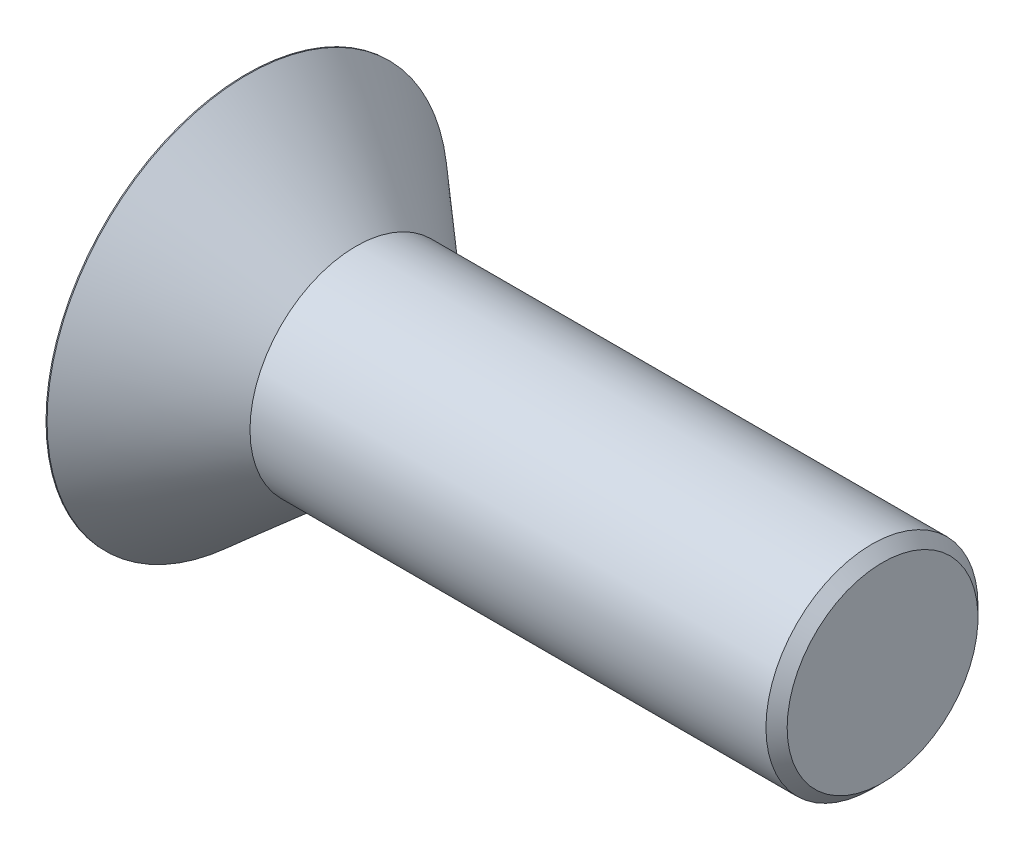
ISO-10303-21;
HEADER;
FILE_DESCRIPTION(('STEP AP214'),'2;1');
FILE_NAME('part.step','',(''),(''),'','','');
FILE_SCHEMA(('AUTOMOTIVE_DESIGN { 1 0 10303 214 1 1 1 1 }'));
ENDSEC;
DATA;
#1=APPLICATION_CONTEXT('core data for automotive mechanical design processes');
#2=APPLICATION_PROTOCOL_DEFINITION('international standard','automotive_design',2000,#1);
#3=PRODUCT_CONTEXT('',#1,'mechanical');
#4=PRODUCT('Part','Part','',(#3));
#5=PRODUCT_RELATED_PRODUCT_CATEGORY('part','',(#4));
#6=PRODUCT_DEFINITION_FORMATION('','',#4);
#7=PRODUCT_DEFINITION_CONTEXT('part definition',#1,'design');
#8=PRODUCT_DEFINITION('design','',#6,#7);
#9=PRODUCT_DEFINITION_SHAPE('','',#8);
#10=(LENGTH_UNIT() NAMED_UNIT(*) SI_UNIT(.MILLI.,.METRE.));
#11=(NAMED_UNIT(*) PLANE_ANGLE_UNIT() SI_UNIT($,.RADIAN.));
#12=(NAMED_UNIT(*) SI_UNIT($,.STERADIAN.) SOLID_ANGLE_UNIT());
#13=UNCERTAINTY_MEASURE_WITH_UNIT(LENGTH_MEASURE(1.E-05),#10,'distance_accuracy_value','');
#14=(GEOMETRIC_REPRESENTATION_CONTEXT(3) GLOBAL_UNCERTAINTY_ASSIGNED_CONTEXT((#13)) GLOBAL_UNIT_ASSIGNED_CONTEXT((#10,
#11,#12)) REPRESENTATION_CONTEXT('',''));
#15=CARTESIAN_POINT('',(0.,0.,0.));
#16=DIRECTION('',(0.,0.,1.));
#17=DIRECTION('',(1.,0.,0.));
#18=AXIS2_PLACEMENT_3D('',#15,#16,#17);
#19=CARTESIAN_POINT('',(0.,0.,0.));
#20=DIRECTION('',(-1.,0.,0.));
#21=DIRECTION('',(0.,0.,1.));
#22=AXIS2_PLACEMENT_3D('',#19,#20,#21);
#23=PLANE('',#22);
#24=CARTESIAN_POINT('',(0.,0.,0.));
#25=DIRECTION('',(-1.,0.,0.));
#26=DIRECTION('',(0.,0.,1.));
#27=AXIS2_PLACEMENT_3D('',#24,#25,#26);
#28=CIRCLE('',#27,24.003);
#29=CARTESIAN_POINT('',(0.,0.,24.003));
#30=VERTEX_POINT('',#29);
#31=EDGE_CURVE('E11',#30,#30,#28,.T.);
#32=ORIENTED_EDGE('',*,*,#31,.T.);
#33=EDGE_LOOP('',(#32));
#34=FACE_BOUND('',#33,.T.);
#35=DIRECTION('',(0.,-0.5,-0.866025403784438));
#36=VECTOR('',#35,1.);
#37=CARTESIAN_POINT('',(0.,-4.58271776169265,7.9375));
#38=LINE('',#37,#36);
#39=CARTESIAN_POINT('',(0.,-4.58271776169265,7.9375));
#40=VERTEX_POINT('',#39);
#41=CARTESIAN_POINT('',(0.,-9.16543552338531,0.));
#42=VERTEX_POINT('',#41);
#43=EDGE_CURVE('E116',#40,#42,#38,.T.);
#44=ORIENTED_EDGE('',*,*,#43,.T.);
#45=DIRECTION('',(0.,0.5,-0.866025403784438));
#46=VECTOR('',#45,1.);
#47=CARTESIAN_POINT('',(0.,-9.16543552338531,0.));
#48=LINE('',#47,#46);
#49=CARTESIAN_POINT('',(0.,-4.58271776169265,-7.9375));
#50=VERTEX_POINT('',#49);
#51=EDGE_CURVE('E46',#42,#50,#48,.T.);
#52=ORIENTED_EDGE('',*,*,#51,.T.);
#53=DIRECTION('',(0.,1.,0.));
#54=VECTOR('',#53,1.);
#55=CARTESIAN_POINT('',(0.,-4.58271776169265,-7.9375));
#56=LINE('',#55,#54);
#57=CARTESIAN_POINT('',(0.,4.58271776169265,-7.9375));
#58=VERTEX_POINT('',#57);
#59=EDGE_CURVE('E131',#50,#58,#56,.T.);
#60=ORIENTED_EDGE('',*,*,#59,.T.);
#61=DIRECTION('',(0.,0.5,0.866025403784439));
#62=VECTOR('',#61,1.);
#63=CARTESIAN_POINT('',(0.,4.58271776169265,-7.9375));
#64=LINE('',#63,#62);
#65=CARTESIAN_POINT('',(0.,9.16543552338531,0.));
#66=VERTEX_POINT('',#65);
#67=EDGE_CURVE('E201',#58,#66,#64,.T.);
#68=ORIENTED_EDGE('',*,*,#67,.T.);
#69=DIRECTION('',(0.,-0.5,0.866025403784439));
#70=VECTOR('',#69,1.);
#71=CARTESIAN_POINT('',(0.,9.16543552338531,0.));
#72=LINE('',#71,#70);
#73=CARTESIAN_POINT('',(0.,4.58271776169265,7.9375));
#74=VERTEX_POINT('',#73);
#75=EDGE_CURVE('E185',#66,#74,#72,.T.);
#76=ORIENTED_EDGE('',*,*,#75,.T.);
#77=DIRECTION('',(0.,-1.,0.));
#78=VECTOR('',#77,1.);
#79=CARTESIAN_POINT('',(0.,4.58271776169265,7.9375));
#80=LINE('',#79,#78);
#81=EDGE_CURVE('E180',#74,#40,#80,.T.);
#82=ORIENTED_EDGE('',*,*,#81,.T.);
#83=EDGE_LOOP('',(#44,#52,#60,#68,#76,#82));
#84=FACE_BOUND('',#83,.T.);
#85=ADVANCED_FACE('F32',(#34,#84),#23,.T.);
#86=CARTESIAN_POINT('',(0.,0.,0.));
#87=DIRECTION('',(-1.,0.,0.));
#88=DIRECTION('',(0.,0.,1.));
#89=AXIS2_PLACEMENT_3D('',#86,#87,#88);
#90=CYLINDRICAL_SURFACE('',#89,24.003);
#91=CARTESIAN_POINT('',(0.127,0.,0.));
#92=DIRECTION('',(-1.,0.,0.));
#93=DIRECTION('',(0.,0.,1.));
#94=AXIS2_PLACEMENT_3D('',#91,#92,#93);
#95=CIRCLE('',#94,24.003);
#96=CARTESIAN_POINT('',(0.127,0.,24.003));
#97=VERTEX_POINT('',#96);
#98=EDGE_CURVE('E39',#97,#97,#95,.T.);
#99=ORIENTED_EDGE('',*,*,#98,.T.);
#100=EDGE_LOOP('',(#99));
#101=FACE_BOUND('',#100,.T.);
#102=ORIENTED_EDGE('',*,*,#31,.F.);
#103=EDGE_LOOP('',(#102));
#104=FACE_BOUND('',#103,.T.);
#105=ADVANCED_FACE('F156',(#101,#104),#90,.T.);
#106=CARTESIAN_POINT('',(0.127,0.,0.));
#107=DIRECTION('',(-1.,0.,0.));
#108=DIRECTION('',(0.,0.,1.));
#109=AXIS2_PLACEMENT_3D('',#106,#107,#108);
#110=CONICAL_SURFACE('',#109,24.003,0.715584993317677);
#111=CARTESIAN_POINT('',(13.129614106819,0.,0.));
#112=DIRECTION('',(-1.,0.,0.));
#113=DIRECTION('',(0.,0.,1.));
#114=AXIS2_PLACEMENT_3D('',#111,#112,#113);
#115=CIRCLE('',#114,12.7);
#116=CARTESIAN_POINT('',(13.129614106819,0.,12.7));
#117=VERTEX_POINT('',#116);
#118=EDGE_CURVE('E151',#117,#117,#115,.T.);
#119=ORIENTED_EDGE('',*,*,#118,.T.);
#120=EDGE_LOOP('',(#119));
#121=FACE_BOUND('',#120,.T.);
#122=ORIENTED_EDGE('',*,*,#98,.F.);
#123=EDGE_LOOP('',(#122));
#124=FACE_BOUND('',#123,.T.);
#125=ADVANCED_FACE('F159',(#121,#124),#110,.T.);
#126=CARTESIAN_POINT('',(0.,0.,0.));
#127=DIRECTION('',(-1.,0.,0.));
#128=DIRECTION('',(0.,0.,1.));
#129=AXIS2_PLACEMENT_3D('',#126,#127,#128);
#130=CYLINDRICAL_SURFACE('',#129,12.7);
#131=CARTESIAN_POINT('',(74.93,0.,0.));
#132=DIRECTION('',(-1.,0.,0.));
#133=DIRECTION('',(0.,0.,1.));
#134=AXIS2_PLACEMENT_3D('',#131,#132,#133);
#135=CIRCLE('',#134,12.7);
#136=CARTESIAN_POINT('',(74.93,0.,12.7));
#137=VERTEX_POINT('',#136);
#138=EDGE_CURVE('E148',#137,#137,#135,.T.);
#139=ORIENTED_EDGE('',*,*,#138,.T.);
#140=EDGE_LOOP('',(#139));
#141=FACE_BOUND('',#140,.T.);
#142=ORIENTED_EDGE('',*,*,#118,.F.);
#143=EDGE_LOOP('',(#142));
#144=FACE_BOUND('',#143,.T.);
#145=ADVANCED_FACE('F161',(#141,#144),#130,.T.);
#146=CARTESIAN_POINT('',(76.2,0.,0.));
#147=DIRECTION('',(-1.,0.,0.));
#148=DIRECTION('',(0.,0.,1.));
#149=AXIS2_PLACEMENT_3D('',#146,#147,#148);
#150=CONICAL_SURFACE('',#149,11.43,0.785398163397468);
#151=ORIENTED_EDGE('',*,*,#138,.F.);
#152=EDGE_LOOP('',(#151));
#153=FACE_BOUND('',#152,.T.);
#154=CARTESIAN_POINT('',(76.2,0.,0.));
#155=DIRECTION('',(-1.,0.,0.));
#156=DIRECTION('',(0.,0.,1.));
#157=AXIS2_PLACEMENT_3D('',#154,#155,#156);
#158=CIRCLE('',#157,11.43);
#159=CARTESIAN_POINT('',(76.2,0.,11.43));
#160=VERTEX_POINT('',#159);
#161=EDGE_CURVE('E144',#160,#160,#158,.T.);
#162=ORIENTED_EDGE('',*,*,#161,.T.);
#163=EDGE_LOOP('',(#162));
#164=FACE_BOUND('',#163,.T.);
#165=ADVANCED_FACE('F168',(#153,#164),#150,.T.);
#166=CARTESIAN_POINT('',(76.2,11.43,0.));
#167=DIRECTION('',(1.,0.,0.));
#168=DIRECTION('',(0.,0.,-1.));
#169=AXIS2_PLACEMENT_3D('',#166,#167,#168);
#170=PLANE('',#169);
#171=ORIENTED_EDGE('',*,*,#161,.F.);
#172=EDGE_LOOP('',(#171));
#173=FACE_BOUND('',#172,.T.);
#174=ADVANCED_FACE('F256',(#173),#170,.T.);
#175=CARTESIAN_POINT('',(7.5438,-9.16543552338531,0.));
#176=DIRECTION('',(0.,0.866025403784439,0.5));
#177=DIRECTION('',(0.,-0.5,0.866025403784439));
#178=AXIS2_PLACEMENT_3D('',#175,#176,#177);
#179=PLANE('',#178);
#180=ORIENTED_EDGE('',*,*,#51,.F.);
#181=DIRECTION('',(-1.,0.,0.));
#182=VECTOR('',#181,1.);
#183=CARTESIAN_POINT('',(7.5438,-9.16543552338531,0.));
#184=LINE('',#183,#182);
#185=CARTESIAN_POINT('',(7.5438,-9.16543552338531,0.));
#186=VERTEX_POINT('',#185);
#187=EDGE_CURVE('E189',#186,#42,#184,.T.);
#188=ORIENTED_EDGE('',*,*,#187,.F.);
#189=DIRECTION('',(0.,0.5,-0.866025403784438));
#190=VECTOR('',#189,1.);
#191=CARTESIAN_POINT('',(7.5438,-9.16543552338531,0.));
#192=LINE('',#191,#190);
#193=CARTESIAN_POINT('',(7.5438,-6.87407664253898,-3.96875));
#194=VERTEX_POINT('',#193);
#195=EDGE_CURVE('E113',#186,#194,#192,.T.);
#196=ORIENTED_EDGE('',*,*,#195,.T.);
#197=CARTESIAN_POINT('',(7.5438,-4.58271776169265,-7.9375));
#198=VERTEX_POINT('',#197);
#199=EDGE_CURVE('E107',#194,#198,#192,.T.);
#200=ORIENTED_EDGE('',*,*,#199,.T.);
#201=DIRECTION('',(-1.,0.,0.));
#202=VECTOR('',#201,1.);
#203=CARTESIAN_POINT('',(7.5438,-4.58271776169265,-7.9375));
#204=LINE('',#203,#202);
#205=EDGE_CURVE('E111',#198,#50,#204,.T.);
#206=ORIENTED_EDGE('',*,*,#205,.T.);
#207=EDGE_LOOP('',(#180,#188,#196,#200,#206));
#208=FACE_BOUND('',#207,.T.);
#209=ADVANCED_FACE('F109',(#208),#179,.T.);
#210=CARTESIAN_POINT('',(7.5438,-4.58271776169265,-7.9375));
#211=DIRECTION('',(0.,0.,1.));
#212=DIRECTION('',(0.,-1.,0.));
#213=AXIS2_PLACEMENT_3D('',#210,#211,#212);
#214=PLANE('',#213);
#215=ORIENTED_EDGE('',*,*,#59,.F.);
#216=ORIENTED_EDGE('',*,*,#205,.F.);
#217=DIRECTION('',(0.,1.,0.));
#218=VECTOR('',#217,1.);
#219=CARTESIAN_POINT('',(7.5438,-4.58271776169265,-7.9375));
#220=LINE('',#219,#218);
#221=CARTESIAN_POINT('',(7.5438,0.,-7.9375));
#222=VERTEX_POINT('',#221);
#223=EDGE_CURVE('E119',#198,#222,#220,.T.);
#224=ORIENTED_EDGE('',*,*,#223,.T.);
#225=CARTESIAN_POINT('',(7.5438,4.58271776169265,-7.9375));
#226=VERTEX_POINT('',#225);
#227=EDGE_CURVE('E126',#222,#226,#220,.T.);
#228=ORIENTED_EDGE('',*,*,#227,.T.);
#229=DIRECTION('',(-1.,0.,0.));
#230=VECTOR('',#229,1.);
#231=CARTESIAN_POINT('',(7.5438,4.58271776169265,-7.9375));
#232=LINE('',#231,#230);
#233=EDGE_CURVE('E133',#226,#58,#232,.T.);
#234=ORIENTED_EDGE('',*,*,#233,.T.);
#235=EDGE_LOOP('',(#215,#216,#224,#228,#234));
#236=FACE_BOUND('',#235,.T.);
#237=ADVANCED_FACE('F128',(#236),#214,.T.);
#238=CARTESIAN_POINT('',(7.5438,4.58271776169265,-7.9375));
#239=DIRECTION('',(0.,-0.866025403784439,0.5));
#240=DIRECTION('',(0.,-0.5,-0.866025403784439));
#241=AXIS2_PLACEMENT_3D('',#238,#239,#240);
#242=PLANE('',#241);
#243=ORIENTED_EDGE('',*,*,#67,.F.);
#244=ORIENTED_EDGE('',*,*,#233,.F.);
#245=DIRECTION('',(0.,0.5,0.866025403784439));
#246=VECTOR('',#245,1.);
#247=CARTESIAN_POINT('',(7.5438,4.58271776169265,-7.9375));
#248=LINE('',#247,#246);
#249=CARTESIAN_POINT('',(7.5438,6.87407664253898,-3.96875));
#250=VERTEX_POINT('',#249);
#251=EDGE_CURVE('E217',#226,#250,#248,.T.);
#252=ORIENTED_EDGE('',*,*,#251,.T.);
#253=CARTESIAN_POINT('',(7.5438,9.16543552338531,0.));
#254=VERTEX_POINT('',#253);
#255=EDGE_CURVE('E125',#250,#254,#248,.T.);
#256=ORIENTED_EDGE('',*,*,#255,.T.);
#257=DIRECTION('',(-1.,0.,0.));
#258=VECTOR('',#257,1.);
#259=CARTESIAN_POINT('',(7.5438,9.16543552338531,0.));
#260=LINE('',#259,#258);
#261=EDGE_CURVE('E139',#254,#66,#260,.T.);
#262=ORIENTED_EDGE('',*,*,#261,.T.);
#263=EDGE_LOOP('',(#243,#244,#252,#256,#262));
#264=FACE_BOUND('',#263,.T.);
#265=ADVANCED_FACE('F199',(#264),#242,.T.);
#266=CARTESIAN_POINT('',(7.5438,9.16543552338531,0.));
#267=DIRECTION('',(0.,-0.866025403784439,-0.5));
#268=DIRECTION('',(0.,0.5,-0.866025403784439));
#269=AXIS2_PLACEMENT_3D('',#266,#267,#268);
#270=PLANE('',#269);
#271=ORIENTED_EDGE('',*,*,#75,.F.);
#272=ORIENTED_EDGE('',*,*,#261,.F.);
#273=DIRECTION('',(0.,-0.5,0.866025403784439));
#274=VECTOR('',#273,1.);
#275=CARTESIAN_POINT('',(7.5438,9.16543552338531,0.));
#276=LINE('',#275,#274);
#277=CARTESIAN_POINT('',(7.5438,6.87407664253898,3.96875));
#278=VERTEX_POINT('',#277);
#279=EDGE_CURVE('E54',#254,#278,#276,.T.);
#280=ORIENTED_EDGE('',*,*,#279,.T.);
#281=CARTESIAN_POINT('',(7.5438,4.58271776169265,7.9375));
#282=VERTEX_POINT('',#281);
#283=EDGE_CURVE('E216',#278,#282,#276,.T.);
#284=ORIENTED_EDGE('',*,*,#283,.T.);
#285=DIRECTION('',(-1.,0.,0.));
#286=VECTOR('',#285,1.);
#287=CARTESIAN_POINT('',(7.5438,4.58271776169265,7.9375));
#288=LINE('',#287,#286);
#289=EDGE_CURVE('E194',#282,#74,#288,.T.);
#290=ORIENTED_EDGE('',*,*,#289,.T.);
#291=EDGE_LOOP('',(#271,#272,#280,#284,#290));
#292=FACE_BOUND('',#291,.T.);
#293=ADVANCED_FACE('F240',(#292),#270,.T.);
#294=CARTESIAN_POINT('',(7.5438,4.58271776169265,7.9375));
#295=DIRECTION('',(0.,0.,-1.));
#296=DIRECTION('',(-1.,0.,0.));
#297=AXIS2_PLACEMENT_3D('',#294,#295,#296);
#298=PLANE('',#297);
#299=ORIENTED_EDGE('',*,*,#81,.F.);
#300=ORIENTED_EDGE('',*,*,#289,.F.);
#301=DIRECTION('',(0.,-1.,0.));
#302=VECTOR('',#301,1.);
#303=CARTESIAN_POINT('',(7.5438,4.58271776169265,7.9375));
#304=LINE('',#303,#302);
#305=CARTESIAN_POINT('',(7.5438,0.,7.9375));
#306=VERTEX_POINT('',#305);
#307=EDGE_CURVE('E211',#282,#306,#304,.T.);
#308=ORIENTED_EDGE('',*,*,#307,.T.);
#309=CARTESIAN_POINT('',(7.5438,-4.58271776169265,7.9375));
#310=VERTEX_POINT('',#309);
#311=EDGE_CURVE('E214',#306,#310,#304,.T.);
#312=ORIENTED_EDGE('',*,*,#311,.T.);
#313=DIRECTION('',(-1.,0.,0.));
#314=VECTOR('',#313,1.);
#315=CARTESIAN_POINT('',(7.5438,-4.58271776169265,7.9375));
#316=LINE('',#315,#314);
#317=EDGE_CURVE('E191',#310,#40,#316,.T.);
#318=ORIENTED_EDGE('',*,*,#317,.T.);
#319=EDGE_LOOP('',(#299,#300,#308,#312,#318));
#320=FACE_BOUND('',#319,.T.);
#321=ADVANCED_FACE('F239',(#320),#298,.T.);
#322=CARTESIAN_POINT('',(7.5438,-4.58271776169265,7.9375));
#323=DIRECTION('',(0.,0.866025403784438,-0.5));
#324=DIRECTION('',(0.,0.5,0.866025403784439));
#325=AXIS2_PLACEMENT_3D('',#322,#323,#324);
#326=PLANE('',#325);
#327=ORIENTED_EDGE('',*,*,#43,.F.);
#328=ORIENTED_EDGE('',*,*,#317,.F.);
#329=DIRECTION('',(0.,-0.5,-0.866025403784438));
#330=VECTOR('',#329,1.);
#331=CARTESIAN_POINT('',(7.5438,-4.58271776169265,7.9375));
#332=LINE('',#331,#330);
#333=CARTESIAN_POINT('',(7.5438,-6.87407664253898,3.96875));
#334=VERTEX_POINT('',#333);
#335=EDGE_CURVE('E192',#310,#334,#332,.T.);
#336=ORIENTED_EDGE('',*,*,#335,.T.);
#337=EDGE_CURVE('E210',#334,#186,#332,.T.);
#338=ORIENTED_EDGE('',*,*,#337,.T.);
#339=ORIENTED_EDGE('',*,*,#187,.T.);
#340=EDGE_LOOP('',(#327,#328,#336,#338,#339));
#341=FACE_BOUND('',#340,.T.);
#342=ADVANCED_FACE('F247',(#341),#326,.T.);
#343=CARTESIAN_POINT('',(7.5438,-9.16543552338531,0.));
#344=DIRECTION('',(-1.,0.,0.));
#345=DIRECTION('',(0.,0.,1.));
#346=AXIS2_PLACEMENT_3D('',#343,#344,#345);
#347=PLANE('',#346);
#348=CARTESIAN_POINT('',(7.5438,0.,0.));
#349=DIRECTION('',(-1.,0.,0.));
#350=DIRECTION('',(0.,0.,1.));
#351=AXIS2_PLACEMENT_3D('',#348,#349,#350);
#352=CIRCLE('',#351,7.9375);
#353=EDGE_CURVE('E132',#334,#306,#352,.T.);
#354=ORIENTED_EDGE('',*,*,#353,.F.);
#355=ORIENTED_EDGE('',*,*,#335,.F.);
#356=ORIENTED_EDGE('',*,*,#311,.F.);
#357=EDGE_LOOP('',(#354,#355,#356));
#358=FACE_BOUND('',#357,.T.);
#359=ADVANCED_FACE('F235',(#358),#347,.T.);
#360=EDGE_CURVE('E136',#194,#334,#352,.T.);
#361=ORIENTED_EDGE('',*,*,#360,.F.);
#362=ORIENTED_EDGE('',*,*,#195,.F.);
#363=ORIENTED_EDGE('',*,*,#337,.F.);
#364=EDGE_LOOP('',(#361,#362,#363));
#365=FACE_BOUND('',#364,.T.);
#366=ADVANCED_FACE('F316',(#365),#347,.T.);
#367=EDGE_CURVE('E121',#222,#194,#352,.T.);
#368=ORIENTED_EDGE('',*,*,#367,.F.);
#369=ORIENTED_EDGE('',*,*,#223,.F.);
#370=ORIENTED_EDGE('',*,*,#199,.F.);
#371=EDGE_LOOP('',(#368,#369,#370));
#372=FACE_BOUND('',#371,.T.);
#373=ADVANCED_FACE('F120',(#372),#347,.T.);
#374=EDGE_CURVE('E222',#250,#222,#352,.T.);
#375=ORIENTED_EDGE('',*,*,#374,.F.);
#376=ORIENTED_EDGE('',*,*,#251,.F.);
#377=ORIENTED_EDGE('',*,*,#227,.F.);
#378=EDGE_LOOP('',(#375,#376,#377));
#379=FACE_BOUND('',#378,.T.);
#380=ADVANCED_FACE('F221',(#379),#347,.T.);
#381=EDGE_CURVE('E145',#278,#250,#352,.T.);
#382=ORIENTED_EDGE('',*,*,#381,.F.);
#383=ORIENTED_EDGE('',*,*,#279,.F.);
#384=ORIENTED_EDGE('',*,*,#255,.F.);
#385=EDGE_LOOP('',(#382,#383,#384));
#386=FACE_BOUND('',#385,.T.);
#387=ADVANCED_FACE('F226',(#386),#347,.T.);
#388=EDGE_CURVE('E138',#306,#278,#352,.T.);
#389=ORIENTED_EDGE('',*,*,#388,.F.);
#390=ORIENTED_EDGE('',*,*,#307,.F.);
#391=ORIENTED_EDGE('',*,*,#283,.F.);
#392=EDGE_LOOP('',(#389,#390,#391));
#393=FACE_BOUND('',#392,.T.);
#394=ADVANCED_FACE('F232',(#393),#347,.T.);
#395=CARTESIAN_POINT('',(7.5438,0.,0.));
#396=DIRECTION('',(-1.,0.,0.));
#397=DIRECTION('',(0.,0.,1.));
#398=AXIS2_PLACEMENT_3D('',#395,#396,#397);
#399=CONICAL_SURFACE('',#398,7.9375,1.04719755119659);
#400=CARTESIAN_POINT('',(12.1265177616927,0.,0.));
#401=VERTEX_POINT('',#400);
#402=VERTEX_LOOP('',#401);
#403=FACE_BOUND('',#402,.T.);
#404=ORIENTED_EDGE('',*,*,#388,.T.);
#405=ORIENTED_EDGE('',*,*,#381,.T.);
#406=ORIENTED_EDGE('',*,*,#374,.T.);
#407=ORIENTED_EDGE('',*,*,#367,.T.);
#408=ORIENTED_EDGE('',*,*,#360,.T.);
#409=ORIENTED_EDGE('',*,*,#353,.T.);
#410=EDGE_LOOP('',(#404,#405,#406,#407,#408,#409));
#411=FACE_BOUND('',#410,.T.);
#412=ADVANCED_FACE('F227',(#403,#411),#399,.F.);
#413=CLOSED_SHELL('',(#85,#105,#125,#145,#165,#174,#209,#237,#265,#293,#321,#342,#359,#366,#373,
#380,#387,#394,#412));
#414=MANIFOLD_SOLID_BREP('B2',#413);
#415=ADVANCED_BREP_SHAPE_REPRESENTATION('',(#18,#414),#14);
#416=SHAPE_DEFINITION_REPRESENTATION(#9,#415);
ENDSEC;
END-ISO-10303-21;
